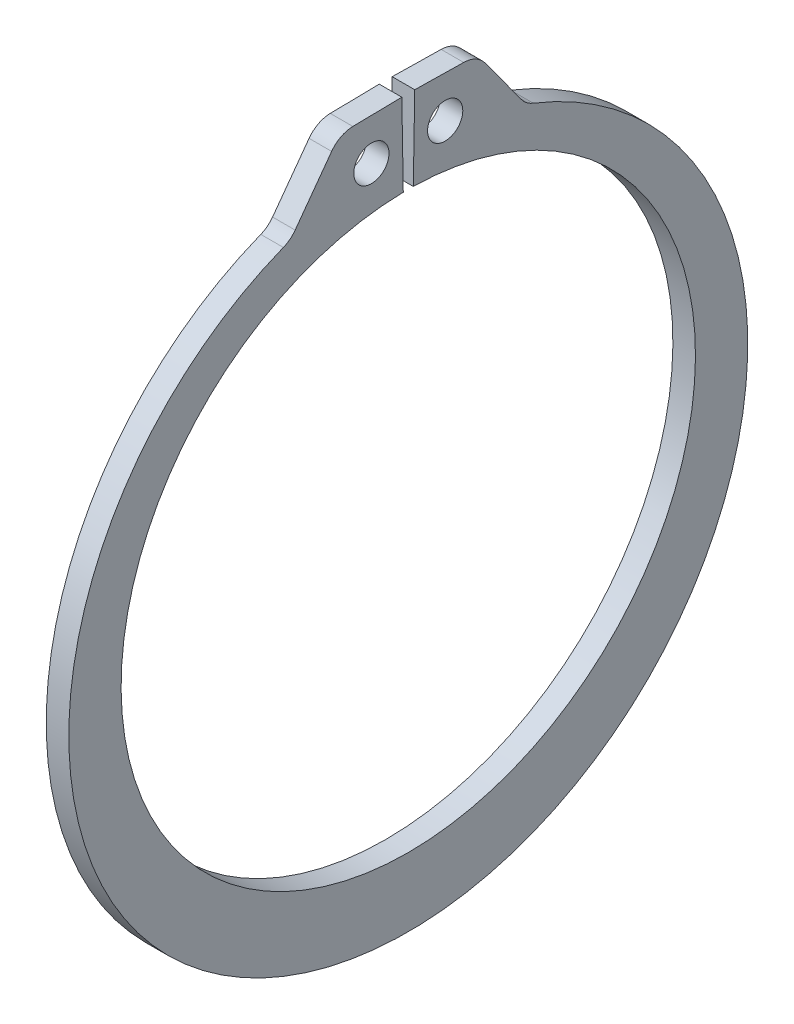
ISO-10303-21;
HEADER;
FILE_DESCRIPTION(('STEP AP214'),'2;1');
FILE_NAME('part.step','',(''),(''),'','','');
FILE_SCHEMA(('AUTOMOTIVE_DESIGN { 1 0 10303 214 1 1 1 1 }'));
ENDSEC;
DATA;
#1=APPLICATION_CONTEXT('core data for automotive mechanical design processes');
#2=APPLICATION_PROTOCOL_DEFINITION('international standard','automotive_design',2000,#1);
#3=PRODUCT_CONTEXT('',#1,'mechanical');
#4=PRODUCT('Part','Part','',(#3));
#5=PRODUCT_RELATED_PRODUCT_CATEGORY('part','',(#4));
#6=PRODUCT_DEFINITION_FORMATION('','',#4);
#7=PRODUCT_DEFINITION_CONTEXT('part definition',#1,'design');
#8=PRODUCT_DEFINITION('design','',#6,#7);
#9=PRODUCT_DEFINITION_SHAPE('','',#8);
#10=(LENGTH_UNIT() NAMED_UNIT(*) SI_UNIT(.MILLI.,.METRE.));
#11=(NAMED_UNIT(*) PLANE_ANGLE_UNIT() SI_UNIT($,.RADIAN.));
#12=(NAMED_UNIT(*) SI_UNIT($,.STERADIAN.) SOLID_ANGLE_UNIT());
#13=UNCERTAINTY_MEASURE_WITH_UNIT(LENGTH_MEASURE(1.E-05),#10,'distance_accuracy_value','');
#14=(GEOMETRIC_REPRESENTATION_CONTEXT(3) GLOBAL_UNCERTAINTY_ASSIGNED_CONTEXT((#13)) GLOBAL_UNIT_ASSIGNED_CONTEXT((#10,
#11,#12)) REPRESENTATION_CONTEXT('',''));
#15=CARTESIAN_POINT('',(0.,0.,0.));
#16=DIRECTION('',(0.,0.,1.));
#17=DIRECTION('',(1.,0.,0.));
#18=AXIS2_PLACEMENT_3D('',#15,#16,#17);
#19=CARTESIAN_POINT('',(0.635,0.,0.));
#20=DIRECTION('',(1.,0.,0.));
#21=DIRECTION('',(0.,0.,-1.));
#22=AXIS2_PLACEMENT_3D('',#19,#20,#21);
#23=PLANE('',#22);
#24=CARTESIAN_POINT('',(0.635,18.4577966131539,2.07504900844418));
#25=DIRECTION('',(1.,0.,0.));
#26=DIRECTION('',(0.,0.,-1.));
#27=AXIS2_PLACEMENT_3D('',#24,#25,#26);
#28=CIRCLE('',#27,0.9906);
#29=CARTESIAN_POINT('',(0.635,18.4577966131539,1.08444900844418));
#30=VERTEX_POINT('',#29);
#31=EDGE_CURVE('E223',#30,#30,#28,.T.);
#32=ORIENTED_EDGE('',*,*,#31,.F.);
#33=EDGE_LOOP('',(#32));
#34=FACE_BOUND('',#33,.T.);
#35=DIRECTION('',(0.,-0.0174524064372825,0.999847695156391));
#36=VECTOR('',#35,1.);
#37=CARTESIAN_POINT('',(0.635,20.8248277947173,0.363498721275741));
#38=LINE('',#37,#36);
#39=CARTESIAN_POINT('',(0.635,20.8248277947173,0.363498721275741));
#40=VERTEX_POINT('',#39);
#41=CARTESIAN_POINT('',(0.635,20.7767554774009,3.11755993583652));
#42=VERTEX_POINT('',#41);
#43=EDGE_CURVE('E135',#40,#42,#38,.T.);
#44=ORIENTED_EDGE('',*,*,#43,.T.);
#45=CARTESIAN_POINT('',(0.635,19.265685655711,3.09118411398786));
#46=DIRECTION('',(1.,0.,0.));
#47=DIRECTION('',(0.,0.,-1.));
#48=AXIS2_PLACEMENT_3D('',#45,#46,#47);
#49=CIRCLE('',#48,1.5113);
#50=CARTESIAN_POINT('',(0.635,20.157616095665,4.31122008898346));
#51=VERTEX_POINT('',#50);
#52=EDGE_CURVE('E176',#42,#51,#49,.T.);
#53=ORIENTED_EDGE('',*,*,#52,.T.);
#54=DIRECTION('',(0.,-0.807275838679021,0.590174313474488));
#55=VECTOR('',#54,1.);
#56=CARTESIAN_POINT('',(0.635,20.7636536196733,3.86816486233792));
#57=LINE('',#56,#55);
#58=CARTESIAN_POINT('',(0.635,17.3506623233126,6.36329688377948));
#59=VERTEX_POINT('',#58);
#60=EDGE_CURVE('E215',#51,#59,#57,.T.);
#61=ORIENTED_EDGE('',*,*,#60,.T.);
#62=CARTESIAN_POINT('',(0.635,18.2425927632666,7.58333285877509));
#63=DIRECTION('',(1.,0.,0.));
#64=DIRECTION('',(0.,0.,-1.));
#65=AXIS2_PLACEMENT_3D('',#62,#63,#64);
#66=CIRCLE('',#65,1.5113);
#67=CARTESIAN_POINT('',(0.635,16.837339847275,7.02719264974763));
#68=VERTEX_POINT('',#67);
#69=EDGE_CURVE('E183',#59,#68,#66,.F.);
#70=ORIENTED_EDGE('',*,*,#69,.T.);
#71=CARTESIAN_POINT('',(0.635,-0.918943194300722,0.));
#72=DIRECTION('',(1.,0.,0.));
#73=DIRECTION('',(0.,0.,-1.));
#74=AXIS2_PLACEMENT_3D('',#71,#72,#73);
#75=CIRCLE('',#74,19.0962568056993);
#76=CARTESIAN_POINT('',(0.635,16.837339847275,-7.02719264974763));
#77=VERTEX_POINT('',#76);
#78=EDGE_CURVE('E208',#68,#77,#75,.T.);
#79=ORIENTED_EDGE('',*,*,#78,.T.);
#80=CARTESIAN_POINT('',(0.635,18.2425927632666,-7.58333285877509));
#81=DIRECTION('',(1.,0.,0.));
#82=DIRECTION('',(0.,0.,-1.));
#83=AXIS2_PLACEMENT_3D('',#80,#81,#82);
#84=CIRCLE('',#83,1.5113);
#85=CARTESIAN_POINT('',(0.635,17.3506623233126,-6.36329688377948));
#86=VERTEX_POINT('',#85);
#87=EDGE_CURVE('E11',#77,#86,#84,.F.);
#88=ORIENTED_EDGE('',*,*,#87,.T.);
#89=DIRECTION('',(0.,0.807275838679021,0.590174313474488));
#90=VECTOR('',#89,1.);
#91=CARTESIAN_POINT('',(0.635,20.7636536196733,-3.86816486233792));
#92=LINE('',#91,#90);
#93=CARTESIAN_POINT('',(0.635,20.157616095665,-4.31122008898346));
#94=VERTEX_POINT('',#93);
#95=EDGE_CURVE('E207',#86,#94,#92,.T.);
#96=ORIENTED_EDGE('',*,*,#95,.T.);
#97=CARTESIAN_POINT('',(0.635,19.265685655711,-3.09118411398786));
#98=DIRECTION('',(1.,0.,0.));
#99=DIRECTION('',(0.,0.,-1.));
#100=AXIS2_PLACEMENT_3D('',#97,#98,#99);
#101=CIRCLE('',#100,1.5113);
#102=CARTESIAN_POINT('',(0.635,20.7767554774009,-3.11755993583652));
#103=VERTEX_POINT('',#102);
#104=EDGE_CURVE('E51',#94,#103,#101,.T.);
#105=ORIENTED_EDGE('',*,*,#104,.T.);
#106=DIRECTION('',(0.,0.0174524064372825,0.999847695156391));
#107=VECTOR('',#106,1.);
#108=CARTESIAN_POINT('',(0.635,20.8248277947173,-0.363498721275741));
#109=LINE('',#108,#107);
#110=CARTESIAN_POINT('',(0.635,20.8248277947173,-0.363498721275741));
#111=VERTEX_POINT('',#110);
#112=EDGE_CURVE('E212',#103,#111,#109,.T.);
#113=ORIENTED_EDGE('',*,*,#112,.T.);
#114=DIRECTION('',(0.,-0.999847695156391,0.0174524064372835));
#115=VECTOR('',#114,1.);
#116=CARTESIAN_POINT('',(0.635,16.1519396066344,-0.281933154550453));
#117=LINE('',#116,#115);
#118=CARTESIAN_POINT('',(0.635,16.1519396066344,-0.281933154550453));
#119=VERTEX_POINT('',#118);
#120=EDGE_CURVE('E141',#111,#119,#117,.T.);
#121=ORIENTED_EDGE('',*,*,#120,.T.);
#122=CARTESIAN_POINT('',(0.635,0.,0.));
#123=DIRECTION('',(-1.,0.,0.));
#124=DIRECTION('',(0.,0.,-1.));
#125=AXIS2_PLACEMENT_3D('',#122,#123,#124);
#126=CIRCLE('',#125,16.1544);
#127=CARTESIAN_POINT('',(0.635,16.1519396066344,0.281933154550453));
#128=VERTEX_POINT('',#127);
#129=EDGE_CURVE('E136',#119,#128,#126,.T.);
#130=ORIENTED_EDGE('',*,*,#129,.T.);
#131=DIRECTION('',(0.,0.999847695156391,0.0174524064372835));
#132=VECTOR('',#131,1.);
#133=CARTESIAN_POINT('',(0.635,16.1519396066344,0.281933154550453));
#134=LINE('',#133,#132);
#135=EDGE_CURVE('E127',#128,#40,#134,.T.);
#136=ORIENTED_EDGE('',*,*,#135,.T.);
#137=EDGE_LOOP('',(#44,#53,#61,#70,#79,#88,#96,#105,#113,#121,#130,#136));
#138=FACE_BOUND('',#137,.T.);
#139=CARTESIAN_POINT('',(0.635,18.4577966131539,-2.07504900844418));
#140=DIRECTION('',(1.,0.,0.));
#141=DIRECTION('',(0.,0.,-1.));
#142=AXIS2_PLACEMENT_3D('',#139,#140,#141);
#143=CIRCLE('',#142,0.9906);
#144=CARTESIAN_POINT('',(0.635,18.4577966131539,-3.06564900844418));
#145=VERTEX_POINT('',#144);
#146=EDGE_CURVE('E249',#145,#145,#143,.T.);
#147=ORIENTED_EDGE('',*,*,#146,.F.);
#148=EDGE_LOOP('',(#147));
#149=FACE_BOUND('',#148,.T.);
#150=ADVANCED_FACE('F36',(#34,#138,#149),#23,.T.);
#151=CARTESIAN_POINT('',(-0.635,0.,0.));
#152=DIRECTION('',(1.,0.,0.));
#153=DIRECTION('',(0.,0.,-1.));
#154=AXIS2_PLACEMENT_3D('',#151,#152,#153);
#155=PLANE('',#154);
#156=CARTESIAN_POINT('',(-0.635,18.4577966131539,2.07504900844418));
#157=DIRECTION('',(1.,0.,0.));
#158=DIRECTION('',(0.,0.,-1.));
#159=AXIS2_PLACEMENT_3D('',#156,#157,#158);
#160=CIRCLE('',#159,0.9906);
#161=CARTESIAN_POINT('',(-0.635,18.4577966131539,1.08444900844418));
#162=VERTEX_POINT('',#161);
#163=EDGE_CURVE('E246',#162,#162,#160,.T.);
#164=ORIENTED_EDGE('',*,*,#163,.T.);
#165=EDGE_LOOP('',(#164));
#166=FACE_BOUND('',#165,.T.);
#167=DIRECTION('',(0.,-0.807275838679021,0.590174313474488));
#168=VECTOR('',#167,1.);
#169=CARTESIAN_POINT('',(-0.635,20.7636536196733,3.86816486233792));
#170=LINE('',#169,#168);
#171=CARTESIAN_POINT('',(-0.635,20.157616095665,4.31122008898346));
#172=VERTEX_POINT('',#171);
#173=CARTESIAN_POINT('',(-0.635,17.3506623233126,6.36329688377948));
#174=VERTEX_POINT('',#173);
#175=EDGE_CURVE('E202',#172,#174,#170,.T.);
#176=ORIENTED_EDGE('',*,*,#175,.F.);
#177=CARTESIAN_POINT('',(-0.635,19.265685655711,3.09118411398786));
#178=DIRECTION('',(1.,0.,0.));
#179=DIRECTION('',(0.,0.,-1.));
#180=AXIS2_PLACEMENT_3D('',#177,#178,#179);
#181=CIRCLE('',#180,1.5113);
#182=CARTESIAN_POINT('',(-0.635,20.7767554774009,3.11755993583652));
#183=VERTEX_POINT('',#182);
#184=EDGE_CURVE('E172',#172,#183,#181,.F.);
#185=ORIENTED_EDGE('',*,*,#184,.T.);
#186=DIRECTION('',(0.,-0.0174524064372825,0.999847695156391));
#187=VECTOR('',#186,1.);
#188=CARTESIAN_POINT('',(-0.635,20.8248277947173,0.363498721275741));
#189=LINE('',#188,#187);
#190=CARTESIAN_POINT('',(-0.635,20.8248277947173,0.363498721275741));
#191=VERTEX_POINT('',#190);
#192=EDGE_CURVE('E225',#191,#183,#189,.T.);
#193=ORIENTED_EDGE('',*,*,#192,.F.);
#194=DIRECTION('',(0.,0.999847695156391,0.0174524064372835));
#195=VECTOR('',#194,1.);
#196=CARTESIAN_POINT('',(-0.635,16.1519396066344,0.281933154550453));
#197=LINE('',#196,#195);
#198=CARTESIAN_POINT('',(-0.635,16.1519396066344,0.281933154550453));
#199=VERTEX_POINT('',#198);
#200=EDGE_CURVE('E222',#199,#191,#197,.T.);
#201=ORIENTED_EDGE('',*,*,#200,.F.);
#202=CARTESIAN_POINT('',(-0.635,0.,0.));
#203=DIRECTION('',(-1.,0.,0.));
#204=DIRECTION('',(0.,0.,-1.));
#205=AXIS2_PLACEMENT_3D('',#202,#203,#204);
#206=CIRCLE('',#205,16.1544);
#207=CARTESIAN_POINT('',(-0.635,16.1519396066344,-0.281933154550453));
#208=VERTEX_POINT('',#207);
#209=EDGE_CURVE('E149',#208,#199,#206,.T.);
#210=ORIENTED_EDGE('',*,*,#209,.F.);
#211=DIRECTION('',(0.,-0.999847695156391,0.0174524064372835));
#212=VECTOR('',#211,1.);
#213=CARTESIAN_POINT('',(-0.635,16.1519396066344,-0.281933154550453));
#214=LINE('',#213,#212);
#215=CARTESIAN_POINT('',(-0.635,20.8248277947173,-0.363498721275741));
#216=VERTEX_POINT('',#215);
#217=EDGE_CURVE('E145',#216,#208,#214,.T.);
#218=ORIENTED_EDGE('',*,*,#217,.F.);
#219=DIRECTION('',(0.,0.0174524064372825,0.999847695156391));
#220=VECTOR('',#219,1.);
#221=CARTESIAN_POINT('',(-0.635,20.8248277947173,-0.363498721275741));
#222=LINE('',#221,#220);
#223=CARTESIAN_POINT('',(-0.635,20.7767554774009,-3.11755993583652));
#224=VERTEX_POINT('',#223);
#225=EDGE_CURVE('E230',#224,#216,#222,.T.);
#226=ORIENTED_EDGE('',*,*,#225,.F.);
#227=CARTESIAN_POINT('',(-0.635,19.265685655711,-3.09118411398786));
#228=DIRECTION('',(1.,0.,0.));
#229=DIRECTION('',(0.,0.,-1.));
#230=AXIS2_PLACEMENT_3D('',#227,#228,#229);
#231=CIRCLE('',#230,1.5113);
#232=CARTESIAN_POINT('',(-0.635,20.157616095665,-4.31122008898346));
#233=VERTEX_POINT('',#232);
#234=EDGE_CURVE('E170',#224,#233,#231,.F.);
#235=ORIENTED_EDGE('',*,*,#234,.T.);
#236=DIRECTION('',(0.,0.807275838679021,0.590174313474488));
#237=VECTOR('',#236,1.);
#238=CARTESIAN_POINT('',(-0.635,20.7636536196733,-3.86816486233792));
#239=LINE('',#238,#237);
#240=CARTESIAN_POINT('',(-0.635,17.3506623233126,-6.36329688377948));
#241=VERTEX_POINT('',#240);
#242=EDGE_CURVE('E193',#241,#233,#239,.T.);
#243=ORIENTED_EDGE('',*,*,#242,.F.);
#244=CARTESIAN_POINT('',(-0.635,18.2425927632666,-7.58333285877509));
#245=DIRECTION('',(1.,0.,0.));
#246=DIRECTION('',(0.,0.,-1.));
#247=AXIS2_PLACEMENT_3D('',#244,#245,#246);
#248=CIRCLE('',#247,1.5113);
#249=CARTESIAN_POINT('',(-0.635,16.837339847275,-7.02719264974763));
#250=VERTEX_POINT('',#249);
#251=EDGE_CURVE('E44',#241,#250,#248,.T.);
#252=ORIENTED_EDGE('',*,*,#251,.T.);
#253=CARTESIAN_POINT('',(-0.635,-0.918943194300722,0.));
#254=DIRECTION('',(1.,0.,0.));
#255=DIRECTION('',(0.,0.,-1.));
#256=AXIS2_PLACEMENT_3D('',#253,#254,#255);
#257=CIRCLE('',#256,19.0962568056993);
#258=CARTESIAN_POINT('',(-0.635,16.837339847275,7.02719264974763));
#259=VERTEX_POINT('',#258);
#260=EDGE_CURVE('E191',#259,#250,#257,.T.);
#261=ORIENTED_EDGE('',*,*,#260,.F.);
#262=CARTESIAN_POINT('',(-0.635,18.2425927632666,7.58333285877509));
#263=DIRECTION('',(1.,0.,0.));
#264=DIRECTION('',(0.,0.,-1.));
#265=AXIS2_PLACEMENT_3D('',#262,#263,#264);
#266=CIRCLE('',#265,1.5113);
#267=EDGE_CURVE('E181',#259,#174,#266,.T.);
#268=ORIENTED_EDGE('',*,*,#267,.T.);
#269=EDGE_LOOP('',(#176,#185,#193,#201,#210,#218,#226,#235,#243,#252,#261,#268));
#270=FACE_BOUND('',#269,.T.);
#271=CARTESIAN_POINT('',(-0.635,18.4577966131539,-2.07504900844418));
#272=DIRECTION('',(1.,0.,0.));
#273=DIRECTION('',(0.,0.,-1.));
#274=AXIS2_PLACEMENT_3D('',#271,#272,#273);
#275=CIRCLE('',#274,0.9906);
#276=CARTESIAN_POINT('',(-0.635,18.4577966131539,-3.06564900844418));
#277=VERTEX_POINT('',#276);
#278=EDGE_CURVE('E252',#277,#277,#275,.T.);
#279=ORIENTED_EDGE('',*,*,#278,.T.);
#280=EDGE_LOOP('',(#279));
#281=FACE_BOUND('',#280,.T.);
#282=ADVANCED_FACE('F189',(#166,#270,#281),#155,.F.);
#283=CARTESIAN_POINT('',(0.635,0.,0.));
#284=DIRECTION('',(-1.,0.,0.));
#285=DIRECTION('',(0.,0.,1.));
#286=AXIS2_PLACEMENT_3D('',#283,#284,#285);
#287=CYLINDRICAL_SURFACE('',#286,16.1544);
#288=ORIENTED_EDGE('',*,*,#209,.T.);
#289=DIRECTION('',(-1.,0.,0.));
#290=VECTOR('',#289,1.);
#291=CARTESIAN_POINT('',(0.635,16.1519396066344,0.281933154550453));
#292=LINE('',#291,#290);
#293=EDGE_CURVE('E131',#128,#199,#292,.T.);
#294=ORIENTED_EDGE('',*,*,#293,.F.);
#295=ORIENTED_EDGE('',*,*,#129,.F.);
#296=DIRECTION('',(-1.,0.,0.));
#297=VECTOR('',#296,1.);
#298=CARTESIAN_POINT('',(0.635,16.1519396066344,-0.281933154550453));
#299=LINE('',#298,#297);
#300=EDGE_CURVE('E220',#119,#208,#299,.T.);
#301=ORIENTED_EDGE('',*,*,#300,.T.);
#302=EDGE_LOOP('',(#288,#294,#295,#301));
#303=FACE_BOUND('',#302,.T.);
#304=ADVANCED_FACE('F147',(#303),#287,.F.);
#305=CARTESIAN_POINT('',(0.635,16.1519396066344,0.281933154550453));
#306=DIRECTION('',(0.,-0.0174524064372835,0.999847695156391));
#307=DIRECTION('',(0.,-0.999847695156391,-0.0174524064372835));
#308=AXIS2_PLACEMENT_3D('',#305,#306,#307);
#309=PLANE('',#308);
#310=ORIENTED_EDGE('',*,*,#200,.T.);
#311=DIRECTION('',(-1.,0.,0.));
#312=VECTOR('',#311,1.);
#313=CARTESIAN_POINT('',(0.635,20.8248277947173,0.363498721275741));
#314=LINE('',#313,#312);
#315=EDGE_CURVE('E134',#40,#191,#314,.T.);
#316=ORIENTED_EDGE('',*,*,#315,.F.);
#317=ORIENTED_EDGE('',*,*,#135,.F.);
#318=ORIENTED_EDGE('',*,*,#293,.T.);
#319=EDGE_LOOP('',(#310,#316,#317,#318));
#320=FACE_BOUND('',#319,.T.);
#321=ADVANCED_FACE('F129',(#320),#309,.F.);
#322=CARTESIAN_POINT('',(0.635,20.8248277947173,0.363498721275741));
#323=DIRECTION('',(0.,-0.999847695156391,-0.0174524064372825));
#324=DIRECTION('',(0.,0.0174524064372825,-0.999847695156391));
#325=AXIS2_PLACEMENT_3D('',#322,#323,#324);
#326=PLANE('',#325);
#327=ORIENTED_EDGE('',*,*,#192,.T.);
#328=DIRECTION('',(-1.,0.,0.));
#329=VECTOR('',#328,1.);
#330=CARTESIAN_POINT('',(0.635,20.7767554774009,3.11755993583652));
#331=LINE('',#330,#329);
#332=EDGE_CURVE('E59',#183,#42,#331,.F.);
#333=ORIENTED_EDGE('',*,*,#332,.T.);
#334=ORIENTED_EDGE('',*,*,#43,.F.);
#335=ORIENTED_EDGE('',*,*,#315,.T.);
#336=EDGE_LOOP('',(#327,#333,#334,#335));
#337=FACE_BOUND('',#336,.T.);
#338=ADVANCED_FACE('F241',(#337),#326,.F.);
#339=CARTESIAN_POINT('',(0.635,20.7636536196733,3.86816486233792));
#340=DIRECTION('',(0.,-0.590174313474488,-0.807275838679021));
#341=DIRECTION('',(0.,0.807275838679021,-0.590174313474488));
#342=AXIS2_PLACEMENT_3D('',#339,#340,#341);
#343=PLANE('',#342);
#344=ORIENTED_EDGE('',*,*,#175,.T.);
#345=DIRECTION('',(1.,0.,0.));
#346=VECTOR('',#345,1.);
#347=CARTESIAN_POINT('',(0.635,17.3506623233126,6.36329688377948));
#348=LINE('',#347,#346);
#349=EDGE_CURVE('E163',#174,#59,#348,.T.);
#350=ORIENTED_EDGE('',*,*,#349,.T.);
#351=ORIENTED_EDGE('',*,*,#60,.F.);
#352=DIRECTION('',(-1.,0.,0.));
#353=VECTOR('',#352,1.);
#354=CARTESIAN_POINT('',(0.635,20.157616095665,4.31122008898346));
#355=LINE('',#354,#353);
#356=EDGE_CURVE('E160',#51,#172,#355,.T.);
#357=ORIENTED_EDGE('',*,*,#356,.T.);
#358=EDGE_LOOP('',(#344,#350,#351,#357));
#359=FACE_BOUND('',#358,.T.);
#360=ADVANCED_FACE('F282',(#359),#343,.F.);
#361=CARTESIAN_POINT('',(0.635,-0.918943194300722,0.));
#362=DIRECTION('',(-1.,0.,0.));
#363=DIRECTION('',(0.,0.,1.));
#364=AXIS2_PLACEMENT_3D('',#361,#362,#363);
#365=CYLINDRICAL_SURFACE('',#364,19.0962568056993);
#366=ORIENTED_EDGE('',*,*,#78,.F.);
#367=DIRECTION('',(-1.,0.,0.));
#368=VECTOR('',#367,1.);
#369=CARTESIAN_POINT('',(0.635,16.837339847275,7.02719264974763));
#370=LINE('',#369,#368);
#371=EDGE_CURVE('E152',#68,#259,#370,.T.);
#372=ORIENTED_EDGE('',*,*,#371,.T.);
#373=ORIENTED_EDGE('',*,*,#260,.T.);
#374=DIRECTION('',(-1.,0.,0.));
#375=VECTOR('',#374,1.);
#376=CARTESIAN_POINT('',(0.635,16.837339847275,-7.02719264974763));
#377=LINE('',#376,#375);
#378=EDGE_CURVE('E150',#250,#77,#377,.F.);
#379=ORIENTED_EDGE('',*,*,#378,.T.);
#380=EDGE_LOOP('',(#366,#372,#373,#379));
#381=FACE_BOUND('',#380,.T.);
#382=ADVANCED_FACE('F199',(#381),#365,.T.);
#383=CARTESIAN_POINT('',(0.635,20.7636536196733,-3.86816486233792));
#384=DIRECTION('',(0.,-0.590174313474488,0.807275838679021));
#385=DIRECTION('',(0.,-0.807275838679021,-0.590174313474488));
#386=AXIS2_PLACEMENT_3D('',#383,#384,#385);
#387=PLANE('',#386);
#388=ORIENTED_EDGE('',*,*,#95,.F.);
#389=DIRECTION('',(1.,0.,0.));
#390=VECTOR('',#389,1.);
#391=CARTESIAN_POINT('',(-0.635,17.3506623233126,-6.36329688377948));
#392=LINE('',#391,#390);
#393=EDGE_CURVE('E167',#86,#241,#392,.F.);
#394=ORIENTED_EDGE('',*,*,#393,.T.);
#395=ORIENTED_EDGE('',*,*,#242,.T.);
#396=DIRECTION('',(-1.,0.,0.));
#397=VECTOR('',#396,1.);
#398=CARTESIAN_POINT('',(0.635,20.157616095665,-4.31122008898346));
#399=LINE('',#398,#397);
#400=EDGE_CURVE('E165',#233,#94,#399,.F.);
#401=ORIENTED_EDGE('',*,*,#400,.T.);
#402=EDGE_LOOP('',(#388,#394,#395,#401));
#403=FACE_BOUND('',#402,.T.);
#404=ADVANCED_FACE('F210',(#403),#387,.F.);
#405=CARTESIAN_POINT('',(0.635,20.8248277947173,-0.363498721275741));
#406=DIRECTION('',(0.,-0.999847695156391,0.0174524064372825));
#407=DIRECTION('',(0.,-0.0174524064372825,-0.999847695156391));
#408=AXIS2_PLACEMENT_3D('',#405,#406,#407);
#409=PLANE('',#408);
#410=ORIENTED_EDGE('',*,*,#112,.F.);
#411=DIRECTION('',(-1.,0.,0.));
#412=VECTOR('',#411,1.);
#413=CARTESIAN_POINT('',(0.635,20.7767554774009,-3.11755993583652));
#414=LINE('',#413,#412);
#415=EDGE_CURVE('E178',#103,#224,#414,.T.);
#416=ORIENTED_EDGE('',*,*,#415,.T.);
#417=ORIENTED_EDGE('',*,*,#225,.T.);
#418=DIRECTION('',(-1.,0.,0.));
#419=VECTOR('',#418,1.);
#420=CARTESIAN_POINT('',(0.635,20.8248277947173,-0.363498721275741));
#421=LINE('',#420,#419);
#422=EDGE_CURVE('E154',#111,#216,#421,.T.);
#423=ORIENTED_EDGE('',*,*,#422,.F.);
#424=EDGE_LOOP('',(#410,#416,#417,#423));
#425=FACE_BOUND('',#424,.T.);
#426=ADVANCED_FACE('F275',(#425),#409,.F.);
#427=CARTESIAN_POINT('',(0.635,16.1519396066344,-0.281933154550453));
#428=DIRECTION('',(0.,-0.0174524064372835,-0.999847695156391));
#429=DIRECTION('',(0.,0.999847695156391,-0.0174524064372835));
#430=AXIS2_PLACEMENT_3D('',#427,#428,#429);
#431=PLANE('',#430);
#432=ORIENTED_EDGE('',*,*,#217,.T.);
#433=ORIENTED_EDGE('',*,*,#300,.F.);
#434=ORIENTED_EDGE('',*,*,#120,.F.);
#435=ORIENTED_EDGE('',*,*,#422,.T.);
#436=EDGE_LOOP('',(#432,#433,#434,#435));
#437=FACE_BOUND('',#436,.T.);
#438=ADVANCED_FACE('F237',(#437),#431,.F.);
#439=CARTESIAN_POINT('',(0.635,18.4577966131539,2.07504900844418));
#440=DIRECTION('',(-1.,0.,0.));
#441=DIRECTION('',(0.,0.,1.));
#442=AXIS2_PLACEMENT_3D('',#439,#440,#441);
#443=CYLINDRICAL_SURFACE('',#442,0.9906);
#444=ORIENTED_EDGE('',*,*,#31,.T.);
#445=EDGE_LOOP('',(#444));
#446=FACE_BOUND('',#445,.T.);
#447=ORIENTED_EDGE('',*,*,#163,.F.);
#448=EDGE_LOOP('',(#447));
#449=FACE_BOUND('',#448,.T.);
#450=ADVANCED_FACE('F270',(#446,#449),#443,.F.);
#451=CARTESIAN_POINT('',(0.635,18.4577966131539,-2.07504900844418));
#452=DIRECTION('',(-1.,0.,0.));
#453=DIRECTION('',(0.,0.,1.));
#454=AXIS2_PLACEMENT_3D('',#451,#452,#453);
#455=CYLINDRICAL_SURFACE('',#454,0.9906);
#456=ORIENTED_EDGE('',*,*,#146,.T.);
#457=EDGE_LOOP('',(#456));
#458=FACE_BOUND('',#457,.T.);
#459=ORIENTED_EDGE('',*,*,#278,.F.);
#460=EDGE_LOOP('',(#459));
#461=FACE_BOUND('',#460,.T.);
#462=ADVANCED_FACE('F258',(#458,#461),#455,.F.);
#463=CARTESIAN_POINT('',(0.635,18.2425927632666,7.58333285877509));
#464=DIRECTION('',(-1.,0.,0.));
#465=DIRECTION('',(0.,0.,1.));
#466=AXIS2_PLACEMENT_3D('',#463,#464,#465);
#467=CYLINDRICAL_SURFACE('',#466,1.5113);
#468=ORIENTED_EDGE('',*,*,#69,.F.);
#469=ORIENTED_EDGE('',*,*,#349,.F.);
#470=ORIENTED_EDGE('',*,*,#267,.F.);
#471=ORIENTED_EDGE('',*,*,#371,.F.);
#472=EDGE_LOOP('',(#468,#469,#470,#471));
#473=FACE_BOUND('',#472,.T.);
#474=ADVANCED_FACE('F292',(#473),#467,.F.);
#475=CARTESIAN_POINT('',(0.635,18.2425927632666,-7.58333285877509));
#476=DIRECTION('',(-1.,0.,0.));
#477=DIRECTION('',(0.,0.,1.));
#478=AXIS2_PLACEMENT_3D('',#475,#476,#477);
#479=CYLINDRICAL_SURFACE('',#478,1.5113);
#480=ORIENTED_EDGE('',*,*,#87,.F.);
#481=ORIENTED_EDGE('',*,*,#378,.F.);
#482=ORIENTED_EDGE('',*,*,#251,.F.);
#483=ORIENTED_EDGE('',*,*,#393,.F.);
#484=EDGE_LOOP('',(#480,#481,#482,#483));
#485=FACE_BOUND('',#484,.T.);
#486=ADVANCED_FACE('F205',(#485),#479,.F.);
#487=CARTESIAN_POINT('',(0.635,19.265685655711,3.09118411398786));
#488=DIRECTION('',(-1.,0.,0.));
#489=DIRECTION('',(0.,0.,1.));
#490=AXIS2_PLACEMENT_3D('',#487,#488,#489);
#491=CYLINDRICAL_SURFACE('',#490,1.5113);
#492=ORIENTED_EDGE('',*,*,#52,.F.);
#493=ORIENTED_EDGE('',*,*,#332,.F.);
#494=ORIENTED_EDGE('',*,*,#184,.F.);
#495=ORIENTED_EDGE('',*,*,#356,.F.);
#496=EDGE_LOOP('',(#492,#493,#494,#495));
#497=FACE_BOUND('',#496,.T.);
#498=ADVANCED_FACE('F297',(#497),#491,.T.);
#499=CARTESIAN_POINT('',(0.635,19.265685655711,-3.09118411398786));
#500=DIRECTION('',(-1.,0.,0.));
#501=DIRECTION('',(0.,0.,1.));
#502=AXIS2_PLACEMENT_3D('',#499,#500,#501);
#503=CYLINDRICAL_SURFACE('',#502,1.5113);
#504=ORIENTED_EDGE('',*,*,#104,.F.);
#505=ORIENTED_EDGE('',*,*,#400,.F.);
#506=ORIENTED_EDGE('',*,*,#234,.F.);
#507=ORIENTED_EDGE('',*,*,#415,.F.);
#508=EDGE_LOOP('',(#504,#505,#506,#507));
#509=FACE_BOUND('',#508,.T.);
#510=ADVANCED_FACE('F38',(#509),#503,.T.);
#511=CLOSED_SHELL('',(#150,#282,#304,#321,#338,#360,#382,#404,#426,#438,#450,#462,#474,#486,
#498,#510));
#512=MANIFOLD_SOLID_BREP('B2',#511);
#513=ADVANCED_BREP_SHAPE_REPRESENTATION('',(#18,#512),#14);
#514=SHAPE_DEFINITION_REPRESENTATION(#9,#513);
ENDSEC;
END-ISO-10303-21;
